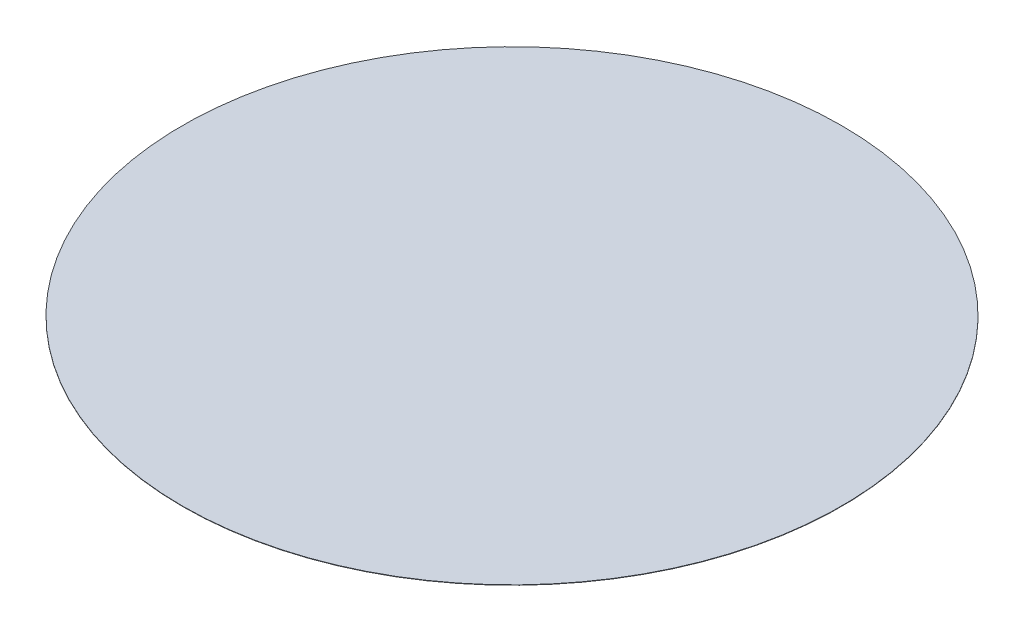
ISO-10303-21;
HEADER;
FILE_DESCRIPTION(('STEP AP214'),'2;1');
FILE_NAME('part.step','',(''),(''),'','','');
FILE_SCHEMA(('AUTOMOTIVE_DESIGN { 1 0 10303 214 1 1 1 1 }'));
ENDSEC;
DATA;
#1=APPLICATION_CONTEXT('core data for automotive mechanical design processes');
#2=APPLICATION_PROTOCOL_DEFINITION('international standard','automotive_design',2000,#1);
#3=PRODUCT_CONTEXT('',#1,'mechanical');
#4=PRODUCT('Part','Part','',(#3));
#5=PRODUCT_RELATED_PRODUCT_CATEGORY('part','',(#4));
#6=PRODUCT_DEFINITION_FORMATION('','',#4);
#7=PRODUCT_DEFINITION_CONTEXT('part definition',#1,'design');
#8=PRODUCT_DEFINITION('design','',#6,#7);
#9=PRODUCT_DEFINITION_SHAPE('','',#8);
#10=(LENGTH_UNIT() NAMED_UNIT(*) SI_UNIT(.MILLI.,.METRE.));
#11=(NAMED_UNIT(*) PLANE_ANGLE_UNIT() SI_UNIT($,.RADIAN.));
#12=(NAMED_UNIT(*) SI_UNIT($,.STERADIAN.) SOLID_ANGLE_UNIT());
#13=UNCERTAINTY_MEASURE_WITH_UNIT(LENGTH_MEASURE(1.E-05),#10,'distance_accuracy_value','');
#14=(GEOMETRIC_REPRESENTATION_CONTEXT(3) GLOBAL_UNCERTAINTY_ASSIGNED_CONTEXT((#13)) GLOBAL_UNIT_ASSIGNED_CONTEXT((#10,
#11,#12)) REPRESENTATION_CONTEXT('',''));
#15=CARTESIAN_POINT('',(0.,0.,0.));
#16=DIRECTION('',(0.,0.,1.));
#17=DIRECTION('',(1.,0.,0.));
#18=AXIS2_PLACEMENT_3D('',#15,#16,#17);
#19=CARTESIAN_POINT('',(0.,0.0254,0.));
#20=DIRECTION('',(0.,-1.,0.));
#21=DIRECTION('',(0.,0.,-1.));
#22=AXIS2_PLACEMENT_3D('',#19,#20,#21);
#23=CYLINDRICAL_SURFACE('',#22,22.5);
#24=CARTESIAN_POINT('',(0.,0.0254,0.));
#25=DIRECTION('',(0.,1.,0.));
#26=DIRECTION('',(0.,0.,1.));
#27=AXIS2_PLACEMENT_3D('',#24,#25,#26);
#28=CIRCLE('',#27,22.5);
#29=CARTESIAN_POINT('',(0.,0.0254,22.5));
#30=VERTEX_POINT('',#29);
#31=EDGE_CURVE('E10',#30,#30,#28,.T.);
#32=ORIENTED_EDGE('',*,*,#31,.F.);
#33=EDGE_LOOP('',(#32));
#34=FACE_BOUND('',#33,.T.);
#35=CARTESIAN_POINT('',(0.,0.,0.));
#36=DIRECTION('',(0.,1.,0.));
#37=DIRECTION('',(0.,0.,1.));
#38=AXIS2_PLACEMENT_3D('',#35,#36,#37);
#39=CIRCLE('',#38,22.5);
#40=CARTESIAN_POINT('',(0.,0.,22.5));
#41=VERTEX_POINT('',#40);
#42=EDGE_CURVE('E40',#41,#41,#39,.T.);
#43=ORIENTED_EDGE('',*,*,#42,.T.);
#44=EDGE_LOOP('',(#43));
#45=FACE_BOUND('',#44,.T.);
#46=ADVANCED_FACE('F37',(#34,#45),#23,.T.);
#47=CARTESIAN_POINT('',(0.,0.0254,0.));
#48=DIRECTION('',(0.,1.,0.));
#49=DIRECTION('',(0.,0.,1.));
#50=AXIS2_PLACEMENT_3D('',#47,#48,#49);
#51=PLANE('',#50);
#52=ORIENTED_EDGE('',*,*,#31,.T.);
#53=EDGE_LOOP('',(#52));
#54=FACE_BOUND('',#53,.T.);
#55=ADVANCED_FACE('F52',(#54),#51,.T.);
#56=CARTESIAN_POINT('',(0.,0.,0.));
#57=DIRECTION('',(0.,1.,0.));
#58=DIRECTION('',(0.,0.,1.));
#59=AXIS2_PLACEMENT_3D('',#56,#57,#58);
#60=PLANE('',#59);
#61=ORIENTED_EDGE('',*,*,#42,.F.);
#62=EDGE_LOOP('',(#61));
#63=FACE_BOUND('',#62,.T.);
#64=ADVANCED_FACE('F50',(#63),#60,.F.);
#65=CLOSED_SHELL('',(#46,#55,#64));
#66=MANIFOLD_SOLID_BREP('B2',#65);
#67=ADVANCED_BREP_SHAPE_REPRESENTATION('',(#18,#66),#14);
#68=SHAPE_DEFINITION_REPRESENTATION(#9,#67);
ENDSEC;
END-ISO-10303-21;
